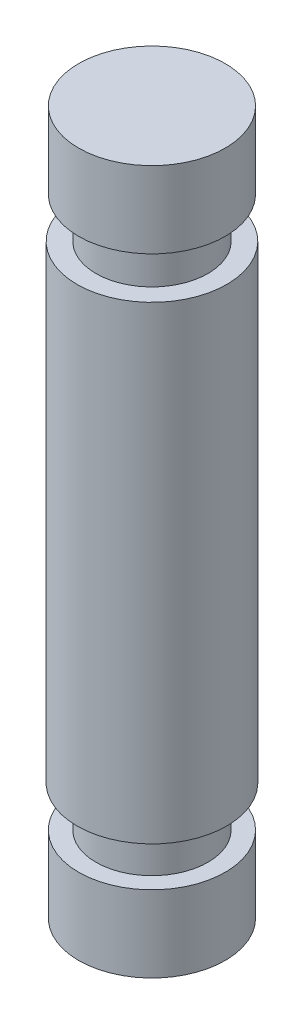
ISO-10303-21;
HEADER;
FILE_DESCRIPTION(('STEP AP214'),'2;1');
FILE_NAME('part.step','',(''),(''),'','','');
FILE_SCHEMA(('AUTOMOTIVE_DESIGN { 1 0 10303 214 1 1 1 1 }'));
ENDSEC;
DATA;
#1=APPLICATION_CONTEXT('core data for automotive mechanical design processes');
#2=APPLICATION_PROTOCOL_DEFINITION('international standard','automotive_design',2000,#1);
#3=PRODUCT_CONTEXT('',#1,'mechanical');
#4=PRODUCT('Part','Part','',(#3));
#5=PRODUCT_RELATED_PRODUCT_CATEGORY('part','',(#4));
#6=PRODUCT_DEFINITION_FORMATION('','',#4);
#7=PRODUCT_DEFINITION_CONTEXT('part definition',#1,'design');
#8=PRODUCT_DEFINITION('design','',#6,#7);
#9=PRODUCT_DEFINITION_SHAPE('','',#8);
#10=(LENGTH_UNIT() NAMED_UNIT(*) SI_UNIT(.MILLI.,.METRE.));
#11=(NAMED_UNIT(*) PLANE_ANGLE_UNIT() SI_UNIT($,.RADIAN.));
#12=(NAMED_UNIT(*) SI_UNIT($,.STERADIAN.) SOLID_ANGLE_UNIT());
#13=UNCERTAINTY_MEASURE_WITH_UNIT(LENGTH_MEASURE(1.E-05),#10,'distance_accuracy_value','');
#14=(GEOMETRIC_REPRESENTATION_CONTEXT(3) GLOBAL_UNCERTAINTY_ASSIGNED_CONTEXT((#13)) GLOBAL_UNIT_ASSIGNED_CONTEXT((#10,
#11,#12)) REPRESENTATION_CONTEXT('',''));
#15=CARTESIAN_POINT('',(0.,0.,0.));
#16=DIRECTION('',(0.,0.,1.));
#17=DIRECTION('',(1.,0.,0.));
#18=AXIS2_PLACEMENT_3D('',#15,#16,#17);
#19=CARTESIAN_POINT('',(0.,3.65,0.));
#20=DIRECTION('',(0.,-1.,0.));
#21=DIRECTION('',(0.,0.,-1.));
#22=AXIS2_PLACEMENT_3D('',#19,#20,#21);
#23=CYLINDRICAL_SURFACE('',#22,3.5);
#24=CARTESIAN_POINT('',(0.,3.65,0.));
#25=DIRECTION('',(0.,1.,0.));
#26=DIRECTION('',(0.,0.,1.));
#27=AXIS2_PLACEMENT_3D('',#24,#25,#26);
#28=CIRCLE('',#27,3.5);
#29=CARTESIAN_POINT('',(0.,3.65,3.5));
#30=VERTEX_POINT('',#29);
#31=EDGE_CURVE('E67',#30,#30,#28,.T.);
#32=ORIENTED_EDGE('',*,*,#31,.F.);
#33=EDGE_LOOP('',(#32));
#34=FACE_BOUND('',#33,.T.);
#35=CARTESIAN_POINT('',(0.,0.,0.));
#36=DIRECTION('',(0.,1.,0.));
#37=DIRECTION('',(0.,0.,1.));
#38=AXIS2_PLACEMENT_3D('',#35,#36,#37);
#39=CIRCLE('',#38,3.5);
#40=CARTESIAN_POINT('',(0.,0.,3.5));
#41=VERTEX_POINT('',#40);
#42=EDGE_CURVE('E55',#41,#41,#39,.T.);
#43=ORIENTED_EDGE('',*,*,#42,.T.);
#44=EDGE_LOOP('',(#43));
#45=FACE_BOUND('',#44,.T.);
#46=ADVANCED_FACE('F52',(#34,#45),#23,.T.);
#47=CARTESIAN_POINT('',(0.,3.65,0.));
#48=DIRECTION('',(0.,1.,0.));
#49=DIRECTION('',(0.,0.,1.));
#50=AXIS2_PLACEMENT_3D('',#47,#48,#49);
#51=PLANE('',#50);
#52=CARTESIAN_POINT('',(0.,3.65,0.));
#53=DIRECTION('',(0.,1.,0.));
#54=DIRECTION('',(0.,0.,1.));
#55=AXIS2_PLACEMENT_3D('',#52,#53,#54);
#56=CIRCLE('',#55,2.675);
#57=CARTESIAN_POINT('',(0.,3.65,2.675));
#58=VERTEX_POINT('',#57);
#59=EDGE_CURVE('E60',#58,#58,#56,.T.);
#60=ORIENTED_EDGE('',*,*,#59,.F.);
#61=EDGE_LOOP('',(#60));
#62=FACE_BOUND('',#61,.T.);
#63=ORIENTED_EDGE('',*,*,#31,.T.);
#64=EDGE_LOOP('',(#63));
#65=FACE_BOUND('',#64,.T.);
#66=ADVANCED_FACE('F98',(#62,#65),#51,.T.);
#67=CARTESIAN_POINT('',(0.,0.,0.));
#68=DIRECTION('',(0.,1.,0.));
#69=DIRECTION('',(0.,0.,1.));
#70=AXIS2_PLACEMENT_3D('',#67,#68,#69);
#71=PLANE('',#70);
#72=ORIENTED_EDGE('',*,*,#42,.F.);
#73=EDGE_LOOP('',(#72));
#74=FACE_BOUND('',#73,.T.);
#75=ADVANCED_FACE('F95',(#74),#71,.F.);
#76=CARTESIAN_POINT('',(0.,5.6,0.));
#77=DIRECTION('',(0.,-1.,0.));
#78=DIRECTION('',(0.,0.,-1.));
#79=AXIS2_PLACEMENT_3D('',#76,#77,#78);
#80=CYLINDRICAL_SURFACE('',#79,2.675);
#81=CARTESIAN_POINT('',(0.,5.6,0.));
#82=DIRECTION('',(0.,1.,0.));
#83=DIRECTION('',(0.,0.,1.));
#84=AXIS2_PLACEMENT_3D('',#81,#82,#83);
#85=CIRCLE('',#84,2.675);
#86=CARTESIAN_POINT('',(0.,5.6,2.675));
#87=VERTEX_POINT('',#86);
#88=EDGE_CURVE('E77',#87,#87,#85,.T.);
#89=ORIENTED_EDGE('',*,*,#88,.F.);
#90=EDGE_LOOP('',(#89));
#91=FACE_BOUND('',#90,.T.);
#92=ORIENTED_EDGE('',*,*,#59,.T.);
#93=EDGE_LOOP('',(#92));
#94=FACE_BOUND('',#93,.T.);
#95=ADVANCED_FACE('F97',(#91,#94),#80,.T.);
#96=CARTESIAN_POINT('',(0.,28.,0.));
#97=DIRECTION('',(0.,-1.,0.));
#98=DIRECTION('',(0.,0.,-1.));
#99=AXIS2_PLACEMENT_3D('',#96,#97,#98);
#100=CYLINDRICAL_SURFACE('',#99,3.575);
#101=CARTESIAN_POINT('',(0.,28.,0.));
#102=DIRECTION('',(0.,1.,0.));
#103=DIRECTION('',(0.,0.,1.));
#104=AXIS2_PLACEMENT_3D('',#101,#102,#103);
#105=CIRCLE('',#104,3.575);
#106=CARTESIAN_POINT('',(0.,28.,3.575));
#107=VERTEX_POINT('',#106);
#108=EDGE_CURVE('E73',#107,#107,#105,.T.);
#109=ORIENTED_EDGE('',*,*,#108,.F.);
#110=EDGE_LOOP('',(#109));
#111=FACE_BOUND('',#110,.T.);
#112=CARTESIAN_POINT('',(0.,5.6,0.));
#113=DIRECTION('',(0.,1.,0.));
#114=DIRECTION('',(0.,0.,1.));
#115=AXIS2_PLACEMENT_3D('',#112,#113,#114);
#116=CIRCLE('',#115,3.575);
#117=CARTESIAN_POINT('',(0.,5.6,3.575));
#118=VERTEX_POINT('',#117);
#119=EDGE_CURVE('E78',#118,#118,#116,.T.);
#120=ORIENTED_EDGE('',*,*,#119,.T.);
#121=EDGE_LOOP('',(#120));
#122=FACE_BOUND('',#121,.T.);
#123=ADVANCED_FACE('F103',(#111,#122),#100,.T.);
#124=CARTESIAN_POINT('',(0.,28.,0.));
#125=DIRECTION('',(0.,1.,0.));
#126=DIRECTION('',(0.,0.,1.));
#127=AXIS2_PLACEMENT_3D('',#124,#125,#126);
#128=PLANE('',#127);
#129=CARTESIAN_POINT('',(0.,28.,0.));
#130=DIRECTION('',(0.,1.,0.));
#131=DIRECTION('',(0.,0.,1.));
#132=AXIS2_PLACEMENT_3D('',#129,#130,#131);
#133=CIRCLE('',#132,2.675);
#134=CARTESIAN_POINT('',(0.,28.,2.675));
#135=VERTEX_POINT('',#134);
#136=EDGE_CURVE('E12',#135,#135,#133,.T.);
#137=ORIENTED_EDGE('',*,*,#136,.F.);
#138=EDGE_LOOP('',(#137));
#139=FACE_BOUND('',#138,.T.);
#140=ORIENTED_EDGE('',*,*,#108,.T.);
#141=EDGE_LOOP('',(#140));
#142=FACE_BOUND('',#141,.T.);
#143=ADVANCED_FACE('F135',(#139,#142),#128,.T.);
#144=CARTESIAN_POINT('',(0.,5.6,0.));
#145=DIRECTION('',(0.,1.,0.));
#146=DIRECTION('',(0.,0.,1.));
#147=AXIS2_PLACEMENT_3D('',#144,#145,#146);
#148=PLANE('',#147);
#149=ORIENTED_EDGE('',*,*,#88,.T.);
#150=EDGE_LOOP('',(#149));
#151=FACE_BOUND('',#150,.T.);
#152=ORIENTED_EDGE('',*,*,#119,.F.);
#153=EDGE_LOOP('',(#152));
#154=FACE_BOUND('',#153,.T.);
#155=ADVANCED_FACE('F144',(#151,#154),#148,.F.);
#156=CARTESIAN_POINT('',(0.,29.95,0.));
#157=DIRECTION('',(0.,-1.,0.));
#158=DIRECTION('',(0.,0.,-1.));
#159=AXIS2_PLACEMENT_3D('',#156,#157,#158);
#160=CYLINDRICAL_SURFACE('',#159,2.675);
#161=CARTESIAN_POINT('',(0.,29.95,0.));
#162=DIRECTION('',(0.,1.,0.));
#163=DIRECTION('',(0.,0.,1.));
#164=AXIS2_PLACEMENT_3D('',#161,#162,#163);
#165=CIRCLE('',#164,2.675);
#166=CARTESIAN_POINT('',(0.,29.95,2.675));
#167=VERTEX_POINT('',#166);
#168=EDGE_CURVE('E71',#167,#167,#165,.T.);
#169=ORIENTED_EDGE('',*,*,#168,.F.);
#170=EDGE_LOOP('',(#169));
#171=FACE_BOUND('',#170,.T.);
#172=ORIENTED_EDGE('',*,*,#136,.T.);
#173=EDGE_LOOP('',(#172));
#174=FACE_BOUND('',#173,.T.);
#175=ADVANCED_FACE('F149',(#171,#174),#160,.T.);
#176=CARTESIAN_POINT('',(0.,33.6,0.));
#177=DIRECTION('',(0.,-1.,0.));
#178=DIRECTION('',(0.,0.,-1.));
#179=AXIS2_PLACEMENT_3D('',#176,#177,#178);
#180=CYLINDRICAL_SURFACE('',#179,3.5);
#181=CARTESIAN_POINT('',(0.,33.6,0.));
#182=DIRECTION('',(0.,1.,0.));
#183=DIRECTION('',(0.,0.,1.));
#184=AXIS2_PLACEMENT_3D('',#181,#182,#183);
#185=CIRCLE('',#184,3.5);
#186=CARTESIAN_POINT('',(0.,33.6,3.5));
#187=VERTEX_POINT('',#186);
#188=EDGE_CURVE('E231',#187,#187,#185,.T.);
#189=ORIENTED_EDGE('',*,*,#188,.F.);
#190=EDGE_LOOP('',(#189));
#191=FACE_BOUND('',#190,.T.);
#192=CARTESIAN_POINT('',(0.,29.95,0.));
#193=DIRECTION('',(0.,1.,0.));
#194=DIRECTION('',(0.,0.,1.));
#195=AXIS2_PLACEMENT_3D('',#192,#193,#194);
#196=CIRCLE('',#195,3.5);
#197=CARTESIAN_POINT('',(0.,29.95,3.5));
#198=VERTEX_POINT('',#197);
#199=EDGE_CURVE('E228',#198,#198,#196,.T.);
#200=ORIENTED_EDGE('',*,*,#199,.T.);
#201=EDGE_LOOP('',(#200));
#202=FACE_BOUND('',#201,.T.);
#203=ADVANCED_FACE('F168',(#191,#202),#180,.T.);
#204=CARTESIAN_POINT('',(0.,33.6,0.));
#205=DIRECTION('',(0.,1.,0.));
#206=DIRECTION('',(0.,0.,1.));
#207=AXIS2_PLACEMENT_3D('',#204,#205,#206);
#208=PLANE('',#207);
#209=ORIENTED_EDGE('',*,*,#188,.T.);
#210=EDGE_LOOP('',(#209));
#211=FACE_BOUND('',#210,.T.);
#212=ADVANCED_FACE('F179',(#211),#208,.T.);
#213=CARTESIAN_POINT('',(0.,29.95,0.));
#214=DIRECTION('',(0.,1.,0.));
#215=DIRECTION('',(0.,0.,1.));
#216=AXIS2_PLACEMENT_3D('',#213,#214,#215);
#217=PLANE('',#216);
#218=ORIENTED_EDGE('',*,*,#168,.T.);
#219=EDGE_LOOP('',(#218));
#220=FACE_BOUND('',#219,.T.);
#221=ORIENTED_EDGE('',*,*,#199,.F.);
#222=EDGE_LOOP('',(#221));
#223=FACE_BOUND('',#222,.T.);
#224=ADVANCED_FACE('F190',(#220,#223),#217,.F.);
#225=CLOSED_SHELL('',(#46,#66,#75,#95,#123,#143,#155,#175,#203,#212,#224));
#226=MANIFOLD_SOLID_BREP('B2',#225);
#227=ADVANCED_BREP_SHAPE_REPRESENTATION('',(#18,#226),#14);
#228=SHAPE_DEFINITION_REPRESENTATION(#9,#227);
ENDSEC;
END-ISO-10303-21;
